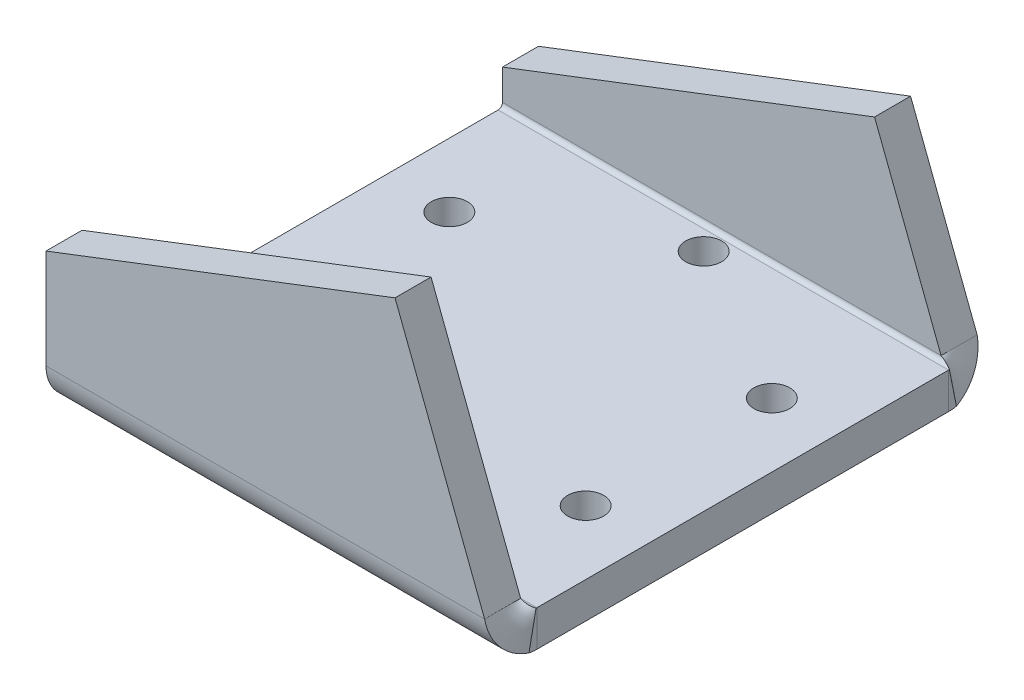
ISO-10303-21;
HEADER;
FILE_DESCRIPTION(('STEP AP214'),'2;1');
FILE_NAME('part.step','',(''),(''),'','','');
FILE_SCHEMA(('AUTOMOTIVE_DESIGN { 1 0 10303 214 1 1 1 1 }'));
ENDSEC;
DATA;
#1=APPLICATION_CONTEXT('core data for automotive mechanical design processes');
#2=APPLICATION_PROTOCOL_DEFINITION('international standard','automotive_design',2000,#1);
#3=PRODUCT_CONTEXT('',#1,'mechanical');
#4=PRODUCT('Part','Part','',(#3));
#5=PRODUCT_RELATED_PRODUCT_CATEGORY('part','',(#4));
#6=PRODUCT_DEFINITION_FORMATION('','',#4);
#7=PRODUCT_DEFINITION_CONTEXT('part definition',#1,'design');
#8=PRODUCT_DEFINITION('design','',#6,#7);
#9=PRODUCT_DEFINITION_SHAPE('','',#8);
#10=(LENGTH_UNIT() NAMED_UNIT(*) SI_UNIT(.MILLI.,.METRE.));
#11=(NAMED_UNIT(*) PLANE_ANGLE_UNIT() SI_UNIT($,.RADIAN.));
#12=(NAMED_UNIT(*) SI_UNIT($,.STERADIAN.) SOLID_ANGLE_UNIT());
#13=UNCERTAINTY_MEASURE_WITH_UNIT(LENGTH_MEASURE(1.E-05),#10,'distance_accuracy_value','');
#14=(GEOMETRIC_REPRESENTATION_CONTEXT(3) GLOBAL_UNCERTAINTY_ASSIGNED_CONTEXT((#13)) GLOBAL_UNIT_ASSIGNED_CONTEXT((#10,
#11,#12)) REPRESENTATION_CONTEXT('',''));
#15=CARTESIAN_POINT('',(0.,0.,0.));
#16=DIRECTION('',(0.,0.,1.));
#17=DIRECTION('',(1.,0.,0.));
#18=AXIS2_PLACEMENT_3D('',#15,#16,#17);
#19=CARTESIAN_POINT('',(0.,-6.,0.));
#20=DIRECTION('',(0.,-1.,0.));
#21=DIRECTION('',(0.,0.,-1.));
#22=AXIS2_PLACEMENT_3D('',#19,#20,#21);
#23=PLANE('',#22);
#24=CARTESIAN_POINT('',(-37.5,-6.,-4.));
#25=DIRECTION('',(0.,-1.,0.));
#26=DIRECTION('',(0.,0.,-1.));
#27=AXIS2_PLACEMENT_3D('',#24,#25,#26);
#28=CIRCLE('',#27,3.);
#29=CARTESIAN_POINT('',(-37.5,-6.,-7.));
#30=VERTEX_POINT('',#29);
#31=EDGE_CURVE('E450',#30,#30,#28,.T.);
#32=ORIENTED_EDGE('',*,*,#31,.F.);
#33=EDGE_LOOP('',(#32));
#34=FACE_BOUND('',#33,.T.);
#35=CARTESIAN_POINT('',(-64.346787517317,-6.,-19.5000000000004));
#36=DIRECTION('',(0.,-1.,0.));
#37=DIRECTION('',(0.,0.,-1.));
#38=AXIS2_PLACEMENT_3D('',#35,#36,#37);
#39=CIRCLE('',#38,3.00000000000001);
#40=CARTESIAN_POINT('',(-64.346787517317,-6.,-22.5000000000005));
#41=VERTEX_POINT('',#40);
#42=EDGE_CURVE('E460',#41,#41,#39,.T.);
#43=ORIENTED_EDGE('',*,*,#42,.F.);
#44=EDGE_LOOP('',(#43));
#45=FACE_BOUND('',#44,.T.);
#46=CARTESIAN_POINT('',(-64.3467875173165,-6.,-50.5000000000005));
#47=DIRECTION('',(0.,-1.,0.));
#48=DIRECTION('',(0.,0.,-1.));
#49=AXIS2_PLACEMENT_3D('',#46,#47,#48);
#50=CIRCLE('',#49,2.99999999999999);
#51=CARTESIAN_POINT('',(-64.3467875173165,-6.,-53.5000000000005));
#52=VERTEX_POINT('',#51);
#53=EDGE_CURVE('E463',#52,#52,#50,.T.);
#54=ORIENTED_EDGE('',*,*,#53,.F.);
#55=EDGE_LOOP('',(#54));
#56=FACE_BOUND('',#55,.T.);
#57=CARTESIAN_POINT('',(-37.4999999999985,-6.,-66.));
#58=DIRECTION('',(0.,-1.,0.));
#59=DIRECTION('',(0.,0.,-1.));
#60=AXIS2_PLACEMENT_3D('',#57,#58,#59);
#61=CIRCLE('',#60,3.);
#62=CARTESIAN_POINT('',(-37.4999999999985,-6.,-69.));
#63=VERTEX_POINT('',#62);
#64=EDGE_CURVE('E469',#63,#63,#61,.T.);
#65=ORIENTED_EDGE('',*,*,#64,.F.);
#66=EDGE_LOOP('',(#65));
#67=FACE_BOUND('',#66,.T.);
#68=CARTESIAN_POINT('',(-10.6532124826812,-6.,-50.4999999999994));
#69=DIRECTION('',(0.,-1.,0.));
#70=DIRECTION('',(0.,0.,-1.));
#71=AXIS2_PLACEMENT_3D('',#68,#69,#70);
#72=CIRCLE('',#71,3.);
#73=CARTESIAN_POINT('',(-10.6532124826812,-6.,-53.4999999999994));
#74=VERTEX_POINT('',#73);
#75=EDGE_CURVE('E466',#74,#74,#72,.T.);
#76=ORIENTED_EDGE('',*,*,#75,.F.);
#77=EDGE_LOOP('',(#76));
#78=FACE_BOUND('',#77,.T.);
#79=CARTESIAN_POINT('',(-10.6532124826819,-6.,-19.4999999999993));
#80=DIRECTION('',(0.,-1.,0.));
#81=DIRECTION('',(0.,0.,-1.));
#82=AXIS2_PLACEMENT_3D('',#79,#80,#81);
#83=CIRCLE('',#82,3.);
#84=CARTESIAN_POINT('',(-10.6532124826819,-6.,-22.4999999999993));
#85=VERTEX_POINT('',#84);
#86=EDGE_CURVE('E459',#85,#85,#83,.T.);
#87=ORIENTED_EDGE('',*,*,#86,.F.);
#88=EDGE_LOOP('',(#87));
#89=FACE_BOUND('',#88,.T.);
#90=DIRECTION('',(0.,0.,-1.));
#91=VECTOR('',#90,1.);
#92=CARTESIAN_POINT('',(0.,-6.,0.));
#93=LINE('',#92,#91);
#94=CARTESIAN_POINT('',(0.,-6.,-0.736599999999992));
#95=VERTEX_POINT('',#94);
#96=CARTESIAN_POINT('',(0.,-6.,-69.2634));
#97=VERTEX_POINT('',#96);
#98=EDGE_CURVE('E534',#95,#97,#93,.T.);
#99=ORIENTED_EDGE('',*,*,#98,.F.);
#100=DIRECTION('',(-1.,0.,0.));
#101=VECTOR('',#100,1.);
#102=CARTESIAN_POINT('',(0.,-6.,-0.736600000000001));
#103=LINE('',#102,#101);
#104=CARTESIAN_POINT('',(-74.9999999999999,-6.,-0.736600000000004));
#105=VERTEX_POINT('',#104);
#106=EDGE_CURVE('E503',#95,#105,#103,.T.);
#107=ORIENTED_EDGE('',*,*,#106,.T.);
#108=DIRECTION('',(0.,0.,1.));
#109=VECTOR('',#108,1.);
#110=CARTESIAN_POINT('',(-75.,-6.,-80.2201516837288));
#111=LINE('',#110,#109);
#112=CARTESIAN_POINT('',(-75.,-6.,-69.2634));
#113=VERTEX_POINT('',#112);
#114=EDGE_CURVE('E495',#113,#105,#111,.T.);
#115=ORIENTED_EDGE('',*,*,#114,.F.);
#116=DIRECTION('',(-1.,0.,0.));
#117=VECTOR('',#116,1.);
#118=CARTESIAN_POINT('',(0.,-6.,-69.2634));
#119=LINE('',#118,#117);
#120=EDGE_CURVE('E491',#97,#113,#119,.T.);
#121=ORIENTED_EDGE('',*,*,#120,.F.);
#122=EDGE_LOOP('',(#99,#107,#115,#121));
#123=FACE_BOUND('',#122,.T.);
#124=ADVANCED_FACE('F61',(#34,#45,#56,#67,#78,#89,#123),#23,.T.);
#125=CARTESIAN_POINT('',(0.,-6.,0.));
#126=DIRECTION('',(1.,0.,0.));
#127=DIRECTION('',(0.,0.,-1.));
#128=AXIS2_PLACEMENT_3D('',#125,#126,#127);
#129=PLANE('',#128);
#130=DIRECTION('',(0.,0.,-1.));
#131=VECTOR('',#130,1.);
#132=CARTESIAN_POINT('',(0.,0.,0.));
#133=LINE('',#132,#131);
#134=CARTESIAN_POINT('',(0.,0.,-0.736600000000001));
#135=VERTEX_POINT('',#134);
#136=CARTESIAN_POINT('',(0.,0.,-69.2634));
#137=VERTEX_POINT('',#136);
#138=EDGE_CURVE('E86',#135,#137,#133,.T.);
#139=ORIENTED_EDGE('',*,*,#138,.F.);
#140=DIRECTION('',(0.,-1.,0.));
#141=VECTOR('',#140,1.);
#142=CARTESIAN_POINT('',(0.,-6.,-0.736600000000001));
#143=LINE('',#142,#141);
#144=EDGE_CURVE('E530',#135,#95,#143,.T.);
#145=ORIENTED_EDGE('',*,*,#144,.T.);
#146=ORIENTED_EDGE('',*,*,#98,.T.);
#147=DIRECTION('',(0.,-1.,0.));
#148=VECTOR('',#147,1.);
#149=CARTESIAN_POINT('',(0.,-6.,-69.2634));
#150=LINE('',#149,#148);
#151=EDGE_CURVE('E500',#137,#97,#150,.T.);
#152=ORIENTED_EDGE('',*,*,#151,.F.);
#153=EDGE_LOOP('',(#139,#145,#146,#152));
#154=FACE_BOUND('',#153,.T.);
#155=ADVANCED_FACE('F578',(#154),#129,.T.);
#156=CARTESIAN_POINT('',(-75.,-6.,21.6936676576655));
#157=DIRECTION('',(-1.,0.,0.));
#158=DIRECTION('',(0.,0.,1.));
#159=AXIS2_PLACEMENT_3D('',#156,#157,#158);
#160=PLANE('',#159);
#161=ORIENTED_EDGE('',*,*,#114,.T.);
#162=DIRECTION('',(0.,1.,0.));
#163=VECTOR('',#162,1.);
#164=CARTESIAN_POINT('',(-75.,-6.,-0.736599999999997));
#165=LINE('',#164,#163);
#166=CARTESIAN_POINT('',(-75.,0.,-0.736599999999997));
#167=VERTEX_POINT('',#166);
#168=EDGE_CURVE('E12',#105,#167,#165,.T.);
#169=ORIENTED_EDGE('',*,*,#168,.T.);
#170=DIRECTION('',(0.,0.,1.));
#171=VECTOR('',#170,1.);
#172=CARTESIAN_POINT('',(-75.,0.,21.6936676576655));
#173=LINE('',#172,#171);
#174=CARTESIAN_POINT('',(-75.,0.,-69.2634));
#175=VERTEX_POINT('',#174);
#176=EDGE_CURVE('E537',#175,#167,#173,.T.);
#177=ORIENTED_EDGE('',*,*,#176,.F.);
#178=DIRECTION('',(0.,1.,0.));
#179=VECTOR('',#178,1.);
#180=CARTESIAN_POINT('',(-75.,-6.00000000000001,-69.2634));
#181=LINE('',#180,#179);
#182=EDGE_CURVE('E494',#113,#175,#181,.T.);
#183=ORIENTED_EDGE('',*,*,#182,.F.);
#184=EDGE_LOOP('',(#161,#169,#177,#183));
#185=FACE_BOUND('',#184,.T.);
#186=ADVANCED_FACE('F63',(#185),#160,.T.);
#187=CARTESIAN_POINT('',(0.,0.,0.));
#188=DIRECTION('',(0.,-1.,0.));
#189=DIRECTION('',(0.,0.,-1.));
#190=AXIS2_PLACEMENT_3D('',#187,#188,#189);
#191=PLANE('',#190);
#192=DIRECTION('',(-1.,0.,0.));
#193=VECTOR('',#192,1.);
#194=CARTESIAN_POINT('',(0.,0.,-0.736600000000001));
#195=LINE('',#194,#193);
#196=EDGE_CURVE('E70',#135,#167,#195,.T.);
#197=ORIENTED_EDGE('',*,*,#196,.F.);
#198=ORIENTED_EDGE('',*,*,#138,.T.);
#199=DIRECTION('',(-1.,0.,0.));
#200=VECTOR('',#199,1.);
#201=CARTESIAN_POINT('',(0.,0.,-69.2634));
#202=LINE('',#201,#200);
#203=EDGE_CURVE('E498',#137,#175,#202,.T.);
#204=ORIENTED_EDGE('',*,*,#203,.T.);
#205=ORIENTED_EDGE('',*,*,#176,.T.);
#206=EDGE_LOOP('',(#197,#198,#204,#205));
#207=FACE_BOUND('',#206,.T.);
#208=CARTESIAN_POINT('',(-37.5,0.,-4.));
#209=DIRECTION('',(0.,-1.,0.));
#210=DIRECTION('',(0.,0.,-1.));
#211=AXIS2_PLACEMENT_3D('',#208,#209,#210);
#212=CIRCLE('',#211,3.);
#213=CARTESIAN_POINT('',(-37.5,0.,-7.));
#214=VERTEX_POINT('',#213);
#215=EDGE_CURVE('E488',#214,#214,#212,.T.);
#216=ORIENTED_EDGE('',*,*,#215,.T.);
#217=EDGE_LOOP('',(#216));
#218=FACE_BOUND('',#217,.T.);
#219=CARTESIAN_POINT('',(-64.346787517317,0.,-19.5000000000004));
#220=DIRECTION('',(0.,-1.,0.));
#221=DIRECTION('',(0.,0.,-1.));
#222=AXIS2_PLACEMENT_3D('',#219,#220,#221);
#223=CIRCLE('',#222,3.00000000000001);
#224=CARTESIAN_POINT('',(-64.346787517317,0.,-22.5000000000005));
#225=VERTEX_POINT('',#224);
#226=EDGE_CURVE('E485',#225,#225,#223,.T.);
#227=ORIENTED_EDGE('',*,*,#226,.T.);
#228=EDGE_LOOP('',(#227));
#229=FACE_BOUND('',#228,.T.);
#230=CARTESIAN_POINT('',(-64.3467875173165,0.,-50.5000000000005));
#231=DIRECTION('',(0.,-1.,0.));
#232=DIRECTION('',(0.,0.,-1.));
#233=AXIS2_PLACEMENT_3D('',#230,#231,#232);
#234=CIRCLE('',#233,2.99999999999999);
#235=CARTESIAN_POINT('',(-64.3467875173165,0.,-53.5000000000005));
#236=VERTEX_POINT('',#235);
#237=EDGE_CURVE('E482',#236,#236,#234,.T.);
#238=ORIENTED_EDGE('',*,*,#237,.T.);
#239=EDGE_LOOP('',(#238));
#240=FACE_BOUND('',#239,.T.);
#241=CARTESIAN_POINT('',(-37.4999999999985,0.,-66.));
#242=DIRECTION('',(0.,-1.,0.));
#243=DIRECTION('',(0.,0.,-1.));
#244=AXIS2_PLACEMENT_3D('',#241,#242,#243);
#245=CIRCLE('',#244,3.);
#246=CARTESIAN_POINT('',(-37.4999999999985,0.,-69.));
#247=VERTEX_POINT('',#246);
#248=EDGE_CURVE('E479',#247,#247,#245,.T.);
#249=ORIENTED_EDGE('',*,*,#248,.T.);
#250=EDGE_LOOP('',(#249));
#251=FACE_BOUND('',#250,.T.);
#252=CARTESIAN_POINT('',(-10.6532124826812,0.,-50.4999999999994));
#253=DIRECTION('',(0.,-1.,0.));
#254=DIRECTION('',(0.,0.,-1.));
#255=AXIS2_PLACEMENT_3D('',#252,#253,#254);
#256=CIRCLE('',#255,3.);
#257=CARTESIAN_POINT('',(-10.6532124826812,0.,-53.4999999999994));
#258=VERTEX_POINT('',#257);
#259=EDGE_CURVE('E476',#258,#258,#256,.T.);
#260=ORIENTED_EDGE('',*,*,#259,.T.);
#261=EDGE_LOOP('',(#260));
#262=FACE_BOUND('',#261,.T.);
#263=CARTESIAN_POINT('',(-10.6532124826819,0.,-19.4999999999993));
#264=DIRECTION('',(0.,-1.,0.));
#265=DIRECTION('',(0.,0.,-1.));
#266=AXIS2_PLACEMENT_3D('',#263,#264,#265);
#267=CIRCLE('',#266,3.);
#268=CARTESIAN_POINT('',(-10.6532124826819,0.,-22.4999999999993));
#269=VERTEX_POINT('',#268);
#270=EDGE_CURVE('E458',#269,#269,#267,.T.);
#271=ORIENTED_EDGE('',*,*,#270,.T.);
#272=EDGE_LOOP('',(#271));
#273=FACE_BOUND('',#272,.T.);
#274=ADVANCED_FACE('F589',(#207,#218,#229,#240,#251,#262,#273),#191,.F.);
#275=CARTESIAN_POINT('',(-10.6532124826819,4.,-19.4999999999993));
#276=DIRECTION('',(0.,-1.,0.));
#277=DIRECTION('',(0.,0.,-1.));
#278=AXIS2_PLACEMENT_3D('',#275,#276,#277);
#279=CYLINDRICAL_SURFACE('',#278,3.);
#280=ORIENTED_EDGE('',*,*,#86,.T.);
#281=EDGE_LOOP('',(#280));
#282=FACE_BOUND('',#281,.T.);
#283=ORIENTED_EDGE('',*,*,#270,.F.);
#284=EDGE_LOOP('',(#283));
#285=FACE_BOUND('',#284,.T.);
#286=ADVANCED_FACE('F591',(#282,#285),#279,.F.);
#287=CARTESIAN_POINT('',(-10.6532124826812,4.,-50.4999999999994));
#288=DIRECTION('',(0.,-1.,0.));
#289=DIRECTION('',(0.,0.,-1.));
#290=AXIS2_PLACEMENT_3D('',#287,#288,#289);
#291=CYLINDRICAL_SURFACE('',#290,3.);
#292=ORIENTED_EDGE('',*,*,#75,.T.);
#293=EDGE_LOOP('',(#292));
#294=FACE_BOUND('',#293,.T.);
#295=ORIENTED_EDGE('',*,*,#259,.F.);
#296=EDGE_LOOP('',(#295));
#297=FACE_BOUND('',#296,.T.);
#298=ADVANCED_FACE('F596',(#294,#297),#291,.F.);
#299=CARTESIAN_POINT('',(-37.4999999999985,4.,-66.));
#300=DIRECTION('',(0.,-1.,0.));
#301=DIRECTION('',(0.,0.,-1.));
#302=AXIS2_PLACEMENT_3D('',#299,#300,#301);
#303=CYLINDRICAL_SURFACE('',#302,3.);
#304=ORIENTED_EDGE('',*,*,#64,.T.);
#305=EDGE_LOOP('',(#304));
#306=FACE_BOUND('',#305,.T.);
#307=ORIENTED_EDGE('',*,*,#248,.F.);
#308=EDGE_LOOP('',(#307));
#309=FACE_BOUND('',#308,.T.);
#310=ADVANCED_FACE('F615',(#306,#309),#303,.F.);
#311=CARTESIAN_POINT('',(-64.3467875173165,4.,-50.5000000000005));
#312=DIRECTION('',(0.,-1.,0.));
#313=DIRECTION('',(0.,0.,-1.));
#314=AXIS2_PLACEMENT_3D('',#311,#312,#313);
#315=CYLINDRICAL_SURFACE('',#314,2.99999999999999);
#316=ORIENTED_EDGE('',*,*,#53,.T.);
#317=EDGE_LOOP('',(#316));
#318=FACE_BOUND('',#317,.T.);
#319=ORIENTED_EDGE('',*,*,#237,.F.);
#320=EDGE_LOOP('',(#319));
#321=FACE_BOUND('',#320,.T.);
#322=ADVANCED_FACE('F621',(#318,#321),#315,.F.);
#323=CARTESIAN_POINT('',(-64.346787517317,4.,-19.5000000000004));
#324=DIRECTION('',(0.,-1.,0.));
#325=DIRECTION('',(0.,0.,-1.));
#326=AXIS2_PLACEMENT_3D('',#323,#324,#325);
#327=CYLINDRICAL_SURFACE('',#326,3.00000000000001);
#328=ORIENTED_EDGE('',*,*,#42,.T.);
#329=EDGE_LOOP('',(#328));
#330=FACE_BOUND('',#329,.T.);
#331=ORIENTED_EDGE('',*,*,#226,.F.);
#332=EDGE_LOOP('',(#331));
#333=FACE_BOUND('',#332,.T.);
#334=ADVANCED_FACE('F626',(#330,#333),#327,.F.);
#335=CARTESIAN_POINT('',(-37.5,4.,-4.));
#336=DIRECTION('',(0.,-1.,0.));
#337=DIRECTION('',(0.,0.,-1.));
#338=AXIS2_PLACEMENT_3D('',#335,#336,#337);
#339=CYLINDRICAL_SURFACE('',#338,3.);
#340=ORIENTED_EDGE('',*,*,#31,.T.);
#341=EDGE_LOOP('',(#340));
#342=FACE_BOUND('',#341,.T.);
#343=ORIENTED_EDGE('',*,*,#215,.F.);
#344=EDGE_LOOP('',(#343));
#345=FACE_BOUND('',#344,.T.);
#346=ADVANCED_FACE('F412',(#342,#345),#339,.F.);
#347=CARTESIAN_POINT('',(-1.97031173492913,0.736599999999999,-76.));
#348=CARTESIAN_POINT('',(-1.80610249301158,-0.0346307257912084,-76.));
#349=CARTESIAN_POINT('',(-1.64192644577427,-0.805527788732326,-75.8663007295514));
#350=CARTESIAN_POINT('',(-1.31354115661941,-2.25777791636665,-75.3469973777911));
#351=CARTESIAN_POINT('',(-1.14934851204199,-2.93871826907082,-74.961513001874));
#352=CARTESIAN_POINT('',(-0.820963222887131,-4.13131883001277,-73.9835506782621));
#353=CARTESIAN_POINT('',(-0.656770578309721,-4.64270413010629,-73.3912981621295));
#354=CARTESIAN_POINT('',(-0.328385289154867,-5.4363829219871,-72.068883560092));
#355=CARTESIAN_POINT('',(-0.164209241917553,-5.71847819432906,-71.3391027478668));
#356=CARTESIAN_POINT('',(0.,-5.8695289656632,-70.5828088255828));
#357=CARTESIAN_POINT('',(-1.97031173492913,0.7366,-70.));
#358=CARTESIAN_POINT('',(-1.80611546962609,0.652277988971885,-70.));
#359=CARTESIAN_POINT('',(-1.64192644577427,0.56797913351242,-69.9853809217391));
#360=CARTESIAN_POINT('',(-1.31354115661941,0.409185759404496,-69.9285987394948));
#361=CARTESIAN_POINT('',(-1.14934851204199,0.334729703856906,-69.8864487244575));
#362=CARTESIAN_POINT('',(-0.820963222887131,0.204327190246207,-69.7795153979171));
#363=CARTESIAN_POINT('',(-0.656770578309721,0.148410791462119,-69.7147567357754));
#364=CARTESIAN_POINT('',(-0.328385289154867,0.0616275776599933,-69.5701599665059));
#365=CARTESIAN_POINT('',(-0.164196265303052,0.0307811313472491,-69.4903570139863));
#366=CARTESIAN_POINT('',(0.,0.0142660932655183,-69.4076681086786));
#367=B_SPLINE_SURFACE_WITH_KNOTS('',1,3,((#347,#348,#349,#350,#351,#352,#353,#354,#355,#356),
(#357,#358,#359,#360,#361,#362,#363,#364,#365,#366)),.UNSPECIFIED.,.F.,.F.,.F.,(2,2),(4,2,2,2,
4),(0.,1.),(0.,0.25,0.5,0.75,1.),.UNSPECIFIED.);
#368=CARTESIAN_POINT('',(-1.97031173492913,0.736599999999999,-76.));
#369=CARTESIAN_POINT('',(-1.97031173492913,0.7366,-70.));
#370=B_SPLINE_CURVE_WITH_KNOTS('',1,(#368,#369),.UNSPECIFIED.,.F.,.F.,(2,2),(0.,1.),.UNSPECIFIED.);
#371=CARTESIAN_POINT('',(-1.97031173492914,0.73659999999999,-70.));
#372=VERTEX_POINT('',#371);
#373=CARTESIAN_POINT('',(-1.97031173492913,0.736600000000014,-76.));
#374=VERTEX_POINT('',#373);
#375=EDGE_CURVE('E318',#372,#374,#370,.F.);
#376=CARTESIAN_POINT('',(-1.97031173492913,0.7366,-70.));
#377=CARTESIAN_POINT('',(-1.80611546962609,0.652277988971885,-70.));
#378=CARTESIAN_POINT('',(-1.64192644577427,0.56797913351242,-69.9853809217391));
#379=CARTESIAN_POINT('',(-1.31354115661941,0.409185759404496,-69.9285987394948));
#380=CARTESIAN_POINT('',(-1.14934851204199,0.334729703856906,-69.8864487244575));
#381=CARTESIAN_POINT('',(-0.820963222887131,0.204327190246207,-69.7795153979171));
#382=CARTESIAN_POINT('',(-0.656770578309721,0.148410791462119,-69.7147567357754));
#383=CARTESIAN_POINT('',(-0.328385289154867,0.0616275776599933,-69.5701599665059));
#384=CARTESIAN_POINT('',(-0.164196265303052,0.0307811313472491,-69.4903570139863));
#385=CARTESIAN_POINT('',(0.,0.0142660932655183,-69.4076681086786));
#386=B_SPLINE_CURVE_WITH_KNOTS('',3,(#376,#377,#378,#379,#380,#381,#382,#383,#384,#385),
.UNSPECIFIED.,.F.,.F.,(4,2,2,2,4),(0.,0.25,0.5,0.75,1.),.UNSPECIFIED.);
#387=CARTESIAN_POINT('',(0.,0.0142660932655182,-69.4076681086786));
#388=VERTEX_POINT('',#387);
#389=EDGE_CURVE('E314',#372,#388,#386,.T.);
#390=CARTESIAN_POINT('',(0.,0.0142660932655183,-69.4076681086786));
#391=CARTESIAN_POINT('',(0.,-5.8695289656632,-70.5828088255828));
#392=B_SPLINE_CURVE_WITH_KNOTS('',1,(#390,#391),.UNSPECIFIED.,.F.,.F.,(2,2),(0.,1.),.UNSPECIFIED.);
#393=CARTESIAN_POINT('',(0.,-5.8695289656632,-70.5828088255828));
#394=VERTEX_POINT('',#393);
#395=EDGE_CURVE('E340',#388,#394,#392,.T.);
#396=CARTESIAN_POINT('',(0.,-5.8695289656632,-70.5828088255828));
#397=CARTESIAN_POINT('',(-0.164209241917553,-5.71847819432906,-71.3391027478668));
#398=CARTESIAN_POINT('',(-0.328385289154867,-5.4363829219871,-72.068883560092));
#399=CARTESIAN_POINT('',(-0.656770578309721,-4.64270413010629,-73.3912981621295));
#400=CARTESIAN_POINT('',(-0.820963222887131,-4.13131883001277,-73.9835506782621));
#401=CARTESIAN_POINT('',(-1.14934851204199,-2.93871826907082,-74.961513001874));
#402=CARTESIAN_POINT('',(-1.31354115661941,-2.25777791636665,-75.3469973777911));
#403=CARTESIAN_POINT('',(-1.64192644577427,-0.805527788732326,-75.8663007295514));
#404=CARTESIAN_POINT('',(-1.80610249301158,-0.0346307257912084,-76.));
#405=CARTESIAN_POINT('',(-1.97031173492913,0.736599999999999,-76.));
#406=B_SPLINE_CURVE_WITH_KNOTS('',3,(#396,#397,#398,#399,#400,#401,#402,#403,#404,#405),
.UNSPECIFIED.,.F.,.F.,(4,2,2,2,4),(0.,0.25,0.5,0.75,1.),.UNSPECIFIED.);
#407=EDGE_CURVE('E345',#374,#394,#406,.F.);
#408=ORIENTED_EDGE('',*,*,#375,.F.);
#409=ORIENTED_EDGE('',*,*,#389,.T.);
#410=ORIENTED_EDGE('',*,*,#395,.T.);
#411=ORIENTED_EDGE('',*,*,#407,.F.);
#412=EDGE_LOOP('',(#408,#409,#410,#411));
#413=FACE_BOUND('',#412,.T.);
#414=ADVANCED_FACE('F401',(#413),#367,.T.);
#415=CARTESIAN_POINT('',(0.,0.7366,-69.2634));
#416=DIRECTION('',(1.,0.,0.));
#417=DIRECTION('',(0.,0.,-1.));
#418=AXIS2_PLACEMENT_3D('',#415,#416,#417);
#419=PLANE('',#418);
#420=ORIENTED_EDGE('',*,*,#395,.F.);
#421=CARTESIAN_POINT('',(0.,0.7366,-69.2634));
#422=DIRECTION('',(1.,0.,0.));
#423=DIRECTION('',(0.,0.,-1.));
#424=AXIS2_PLACEMENT_3D('',#421,#422,#423);
#425=CIRCLE('',#424,0.7366);
#426=EDGE_CURVE('E346',#388,#137,#425,.F.);
#427=ORIENTED_EDGE('',*,*,#426,.T.);
#428=ORIENTED_EDGE('',*,*,#151,.T.);
#429=CARTESIAN_POINT('',(0.,0.7366,-69.2634));
#430=DIRECTION('',(-1.,0.,0.));
#431=DIRECTION('',(0.,0.,-1.));
#432=AXIS2_PLACEMENT_3D('',#429,#430,#431);
#433=CIRCLE('',#432,6.7366);
#434=EDGE_CURVE('E341',#394,#97,#433,.T.);
#435=ORIENTED_EDGE('',*,*,#434,.F.);
#436=EDGE_LOOP('',(#420,#427,#428,#435));
#437=FACE_BOUND('',#436,.T.);
#438=ADVANCED_FACE('F377',(#437),#419,.T.);
#439=CARTESIAN_POINT('',(-75.,0.7366,-69.2634));
#440=DIRECTION('',(-1.,0.,0.));
#441=DIRECTION('',(0.,0.,1.));
#442=AXIS2_PLACEMENT_3D('',#439,#440,#441);
#443=PLANE('',#442);
#444=CARTESIAN_POINT('',(-75.,0.7366,-69.2634));
#445=DIRECTION('',(1.,0.,0.));
#446=DIRECTION('',(0.,0.,-1.));
#447=AXIS2_PLACEMENT_3D('',#444,#445,#446);
#448=CIRCLE('',#447,0.7366);
#449=CARTESIAN_POINT('',(-75.,0.73659999999999,-70.));
#450=VERTEX_POINT('',#449);
#451=EDGE_CURVE('E342',#175,#450,#448,.T.);
#452=ORIENTED_EDGE('',*,*,#451,.T.);
#453=DIRECTION('',(0.,0.,1.));
#454=VECTOR('',#453,1.);
#455=CARTESIAN_POINT('',(-75.,0.736600000000018,-76.));
#456=LINE('',#455,#454);
#457=CARTESIAN_POINT('',(-75.,0.736600000000018,-76.));
#458=VERTEX_POINT('',#457);
#459=EDGE_CURVE('E323',#458,#450,#456,.T.);
#460=ORIENTED_EDGE('',*,*,#459,.F.);
#461=CARTESIAN_POINT('',(-75.,0.7366,-69.2634));
#462=DIRECTION('',(1.,0.,0.));
#463=DIRECTION('',(0.,0.,1.));
#464=AXIS2_PLACEMENT_3D('',#461,#462,#463);
#465=CIRCLE('',#464,6.7366);
#466=EDGE_CURVE('E337',#113,#458,#465,.T.);
#467=ORIENTED_EDGE('',*,*,#466,.F.);
#468=ORIENTED_EDGE('',*,*,#182,.T.);
#469=EDGE_LOOP('',(#452,#460,#467,#468));
#470=FACE_BOUND('',#469,.T.);
#471=ADVANCED_FACE('F368',(#470),#443,.T.);
#472=CARTESIAN_POINT('',(-112.968207194875,0.7366,-69.2634));
#473=DIRECTION('',(1.,0.,0.));
#474=DIRECTION('',(0.,0.,-1.));
#475=AXIS2_PLACEMENT_3D('',#472,#473,#474);
#476=CYLINDRICAL_SURFACE('',#475,6.7366);
#477=ORIENTED_EDGE('',*,*,#120,.T.);
#478=ORIENTED_EDGE('',*,*,#466,.T.);
#479=DIRECTION('',(-1.,0.,0.));
#480=VECTOR('',#479,1.);
#481=CARTESIAN_POINT('',(0.,0.736600000000018,-76.));
#482=LINE('',#481,#480);
#483=EDGE_CURVE('E329',#374,#458,#482,.T.);
#484=ORIENTED_EDGE('',*,*,#483,.F.);
#485=ORIENTED_EDGE('',*,*,#407,.T.);
#486=ORIENTED_EDGE('',*,*,#434,.T.);
#487=EDGE_LOOP('',(#477,#478,#484,#485,#486));
#488=FACE_BOUND('',#487,.T.);
#489=ADVANCED_FACE('F357',(#488),#476,.T.);
#490=CARTESIAN_POINT('',(-112.968207194875,0.7366,-69.2634));
#491=DIRECTION('',(1.,0.,0.));
#492=DIRECTION('',(0.,0.,-1.));
#493=AXIS2_PLACEMENT_3D('',#490,#491,#492);
#494=CYLINDRICAL_SURFACE('',#493,0.7366);
#495=ORIENTED_EDGE('',*,*,#203,.F.);
#496=ORIENTED_EDGE('',*,*,#426,.F.);
#497=ORIENTED_EDGE('',*,*,#389,.F.);
#498=DIRECTION('',(-1.,0.,0.));
#499=VECTOR('',#498,1.);
#500=CARTESIAN_POINT('',(0.,0.73659999999999,-70.));
#501=LINE('',#500,#499);
#502=EDGE_CURVE('E336',#372,#450,#501,.T.);
#503=ORIENTED_EDGE('',*,*,#502,.T.);
#504=ORIENTED_EDGE('',*,*,#451,.F.);
#505=EDGE_LOOP('',(#495,#496,#497,#503,#504));
#506=FACE_BOUND('',#505,.T.);
#507=ADVANCED_FACE('F367',(#506),#494,.F.);
#508=CARTESIAN_POINT('',(-13.051377191204,29.6037624452982,-75.9999999999999));
#509=DIRECTION('',(-0.358367949545298,0.933580426497203,0.));
#510=DIRECTION('',(-0.933580426497203,-0.358367949545298,0.));
#511=AXIS2_PLACEMENT_3D('',#508,#509,#510);
#512=PLANE('',#511);
#513=DIRECTION('',(-0.933580426497203,-0.358367949545298,0.));
#514=VECTOR('',#513,1.);
#515=CARTESIAN_POINT('',(-13.051377191204,29.6037624452982,-69.9999999999999));
#516=LINE('',#515,#514);
#517=CARTESIAN_POINT('',(-13.051377191204,29.6037624452982,-69.9999999999999));
#518=VERTEX_POINT('',#517);
#519=CARTESIAN_POINT('',(-75.,5.82391412902693,-70.));
#520=VERTEX_POINT('',#519);
#521=EDGE_CURVE('E319',#518,#520,#516,.T.);
#522=ORIENTED_EDGE('',*,*,#521,.F.);
#523=DIRECTION('',(0.,0.,1.));
#524=VECTOR('',#523,1.);
#525=CARTESIAN_POINT('',(-13.051377191204,29.6037624452982,-75.9999999999999));
#526=LINE('',#525,#524);
#527=CARTESIAN_POINT('',(-13.051377191204,29.6037624452982,-75.9999999999999));
#528=VERTEX_POINT('',#527);
#529=EDGE_CURVE('E306',#528,#518,#526,.T.);
#530=ORIENTED_EDGE('',*,*,#529,.F.);
#531=DIRECTION('',(-0.933580426497203,-0.358367949545298,0.));
#532=VECTOR('',#531,1.);
#533=CARTESIAN_POINT('',(-13.051377191204,29.6037624452982,-75.9999999999999));
#534=LINE('',#533,#532);
#535=CARTESIAN_POINT('',(-75.,5.82391412902696,-76.));
#536=VERTEX_POINT('',#535);
#537=EDGE_CURVE('E333',#528,#536,#534,.T.);
#538=ORIENTED_EDGE('',*,*,#537,.T.);
#539=DIRECTION('',(0.,0.,1.));
#540=VECTOR('',#539,1.);
#541=CARTESIAN_POINT('',(-75.,5.82391412902696,-76.));
#542=LINE('',#541,#540);
#543=EDGE_CURVE('E330',#536,#520,#542,.T.);
#544=ORIENTED_EDGE('',*,*,#543,.T.);
#545=EDGE_LOOP('',(#522,#530,#538,#544));
#546=FACE_BOUND('',#545,.T.);
#547=ADVANCED_FACE('F375',(#546),#512,.T.);
#548=CARTESIAN_POINT('',(0.,-74.3962375547018,-76.0000000000003));
#549=DIRECTION('',(0.,0.,-1.));
#550=DIRECTION('',(0.,1.,0.));
#551=AXIS2_PLACEMENT_3D('',#548,#549,#550);
#552=PLANE('',#551);
#553=DIRECTION('',(-0.358367949545298,0.933580426497203,0.));
#554=VECTOR('',#553,1.);
#555=CARTESIAN_POINT('',(-13.051377191204,29.6037624452982,-75.9999999999999));
#556=LINE('',#555,#554);
#557=EDGE_CURVE('E315',#374,#528,#556,.T.);
#558=ORIENTED_EDGE('',*,*,#557,.F.);
#559=ORIENTED_EDGE('',*,*,#483,.T.);
#560=DIRECTION('',(0.,-1.,0.));
#561=VECTOR('',#560,1.);
#562=CARTESIAN_POINT('',(-75.,5.82391412902696,-76.));
#563=LINE('',#562,#561);
#564=EDGE_CURVE('E326',#536,#458,#563,.T.);
#565=ORIENTED_EDGE('',*,*,#564,.F.);
#566=ORIENTED_EDGE('',*,*,#537,.F.);
#567=EDGE_LOOP('',(#558,#559,#565,#566));
#568=FACE_BOUND('',#567,.T.);
#569=ADVANCED_FACE('F767',(#568),#552,.T.);
#570=CARTESIAN_POINT('',(-75.,-96.0899052123673,-76.0000000000003));
#571=DIRECTION('',(-1.,0.,0.));
#572=DIRECTION('',(0.,-1.,0.));
#573=AXIS2_PLACEMENT_3D('',#570,#571,#572);
#574=PLANE('',#573);
#575=ORIENTED_EDGE('',*,*,#564,.T.);
#576=ORIENTED_EDGE('',*,*,#459,.T.);
#577=DIRECTION('',(0.,-1.,0.));
#578=VECTOR('',#577,1.);
#579=CARTESIAN_POINT('',(-75.,-96.0899052123673,-70.0000000000003));
#580=LINE('',#579,#578);
#581=EDGE_CURVE('E316',#520,#450,#580,.T.);
#582=ORIENTED_EDGE('',*,*,#581,.F.);
#583=ORIENTED_EDGE('',*,*,#543,.F.);
#584=EDGE_LOOP('',(#575,#576,#582,#583));
#585=FACE_BOUND('',#584,.T.);
#586=ADVANCED_FACE('F759',(#585),#574,.T.);
#587=CARTESIAN_POINT('',(0.,-74.3962375547018,-70.0000000000003));
#588=DIRECTION('',(0.,0.,-1.));
#589=DIRECTION('',(0.,1.,0.));
#590=AXIS2_PLACEMENT_3D('',#587,#588,#589);
#591=PLANE('',#590);
#592=ORIENTED_EDGE('',*,*,#502,.F.);
#593=DIRECTION('',(-0.358367949545298,0.933580426497203,0.));
#594=VECTOR('',#593,1.);
#595=CARTESIAN_POINT('',(-13.051377191204,29.6037624452982,-69.9999999999999));
#596=LINE('',#595,#594);
#597=EDGE_CURVE('E322',#372,#518,#596,.T.);
#598=ORIENTED_EDGE('',*,*,#597,.T.);
#599=ORIENTED_EDGE('',*,*,#521,.T.);
#600=ORIENTED_EDGE('',*,*,#581,.T.);
#601=EDGE_LOOP('',(#592,#598,#599,#600));
#602=FACE_BOUND('',#601,.T.);
#603=ADVANCED_FACE('F750',(#602),#591,.F.);
#604=CARTESIAN_POINT('',(-13.051377191204,29.6037624452982,-75.9999999999999));
#605=DIRECTION('',(0.933580426497203,0.358367949545298,0.));
#606=DIRECTION('',(-0.358367949545298,0.933580426497203,0.));
#607=AXIS2_PLACEMENT_3D('',#604,#605,#606);
#608=PLANE('',#607);
#609=ORIENTED_EDGE('',*,*,#597,.F.);
#610=ORIENTED_EDGE('',*,*,#375,.T.);
#611=ORIENTED_EDGE('',*,*,#557,.T.);
#612=ORIENTED_EDGE('',*,*,#529,.T.);
#613=EDGE_LOOP('',(#609,#610,#611,#612));
#614=FACE_BOUND('',#613,.T.);
#615=ADVANCED_FACE('F267',(#614),#608,.T.);
#616=CARTESIAN_POINT('',(0.,-5.8695289656632,0.582808825582763));
#617=CARTESIAN_POINT('',(-0.164209241917558,-5.71847819432906,1.33910274786682));
#618=CARTESIAN_POINT('',(-0.328385289154858,-5.4363829219871,2.06888356009199));
#619=CARTESIAN_POINT('',(-0.656770578309716,-4.6427041301063,3.39129816212951));
#620=CARTESIAN_POINT('',(-0.820963222887145,-4.13131883001277,3.98355067826208));
#621=CARTESIAN_POINT('',(-1.149348512042,-2.93871826907083,4.96151300187396));
#622=CARTESIAN_POINT('',(-1.31354115661943,-2.25777791636665,5.34699737779109));
#623=CARTESIAN_POINT('',(-1.64192644577429,-0.805527788732325,5.8663007295514));
#624=CARTESIAN_POINT('',(-1.80610249301159,-0.0346307257912124,6.));
#625=CARTESIAN_POINT('',(-1.97031173492915,0.736599999999999,6.));
#626=CARTESIAN_POINT('',(0.,0.0142660932655175,-0.592331891321399));
#627=CARTESIAN_POINT('',(-0.164196265303058,0.0307811313472487,-0.5096429860137));
#628=CARTESIAN_POINT('',(-0.328385289154858,0.0616275776599918,-0.429840033494083));
#629=CARTESIAN_POINT('',(-0.656770578309716,0.148410791462117,-0.285243264224595));
#630=CARTESIAN_POINT('',(-0.820963222887145,0.204327190246206,-0.220484602082973));
#631=CARTESIAN_POINT('',(-1.149348512042,0.334729703856906,-0.113551275542505));
#632=CARTESIAN_POINT('',(-1.31354115661943,0.409185759404496,-0.0714012605051641));
#633=CARTESIAN_POINT('',(-1.64192644577429,0.567979133512421,-0.0146190782609093));
#634=CARTESIAN_POINT('',(-1.80611546962609,0.65227798897188,0.));
#635=CARTESIAN_POINT('',(-1.97031173492915,0.7366,0.));
#636=B_SPLINE_SURFACE_WITH_KNOTS('',1,3,((#616,#617,#618,#619,#620,#621,#622,#623,#624,#625),
(#626,#627,#628,#629,#630,#631,#632,#633,#634,#635)),.UNSPECIFIED.,.F.,.F.,.F.,(2,2),(4,2,2,2,
4),(0.,1.),(0.,0.25,0.5,0.75,1.),.UNSPECIFIED.);
#637=CARTESIAN_POINT('',(0.,-5.8695289656632,0.582808825582763));
#638=CARTESIAN_POINT('',(0.,0.0142660932655175,-0.592331891321399));
#639=B_SPLINE_CURVE_WITH_KNOTS('',1,(#637,#638),.UNSPECIFIED.,.F.,.F.,(2,2),(0.,1.),.UNSPECIFIED.);
#640=CARTESIAN_POINT('',(0.,0.014266093265518,-0.5923318913214));
#641=VERTEX_POINT('',#640);
#642=CARTESIAN_POINT('',(0.,-5.8695289656632,0.582808825582763));
#643=VERTEX_POINT('',#642);
#644=EDGE_CURVE('E294',#641,#643,#639,.F.);
#645=CARTESIAN_POINT('',(0.,0.0142660932655175,-0.592331891321399));
#646=CARTESIAN_POINT('',(-0.164196265303058,0.0307811313472487,-0.5096429860137));
#647=CARTESIAN_POINT('',(-0.328385289154858,0.0616275776599918,-0.429840033494083));
#648=CARTESIAN_POINT('',(-0.656770578309716,0.148410791462117,-0.285243264224595));
#649=CARTESIAN_POINT('',(-0.820963222887145,0.204327190246206,-0.220484602082973));
#650=CARTESIAN_POINT('',(-1.149348512042,0.334729703856906,-0.113551275542505));
#651=CARTESIAN_POINT('',(-1.31354115661943,0.409185759404496,-0.0714012605051641));
#652=CARTESIAN_POINT('',(-1.64192644577429,0.567979133512421,-0.0146190782609093));
#653=CARTESIAN_POINT('',(-1.80611546962609,0.65227798897188,0.));
#654=CARTESIAN_POINT('',(-1.97031173492915,0.7366,0.));
#655=B_SPLINE_CURVE_WITH_KNOTS('',3,(#645,#646,#647,#648,#649,#650,#651,#652,#653,#654),
.UNSPECIFIED.,.F.,.F.,(4,2,2,2,4),(0.,0.25,0.5,0.75,1.),.UNSPECIFIED.);
#656=CARTESIAN_POINT('',(-1.97031173492913,0.736599999999995,0.));
#657=VERTEX_POINT('',#656);
#658=EDGE_CURVE('E183',#641,#657,#655,.T.);
#659=CARTESIAN_POINT('',(-1.97031173492915,0.7366,0.));
#660=CARTESIAN_POINT('',(-1.97031173492915,0.736599999999999,6.));
#661=B_SPLINE_CURVE_WITH_KNOTS('',1,(#659,#660),.UNSPECIFIED.,.F.,.F.,(2,2),(0.,1.),.UNSPECIFIED.);
#662=CARTESIAN_POINT('',(-1.97031173492914,0.736600000000019,6.));
#663=VERTEX_POINT('',#662);
#664=EDGE_CURVE('E190',#657,#663,#661,.T.);
#665=CARTESIAN_POINT('',(-1.97031173492915,0.736599999999999,6.));
#666=CARTESIAN_POINT('',(-1.80610249301159,-0.0346307257912124,6.));
#667=CARTESIAN_POINT('',(-1.64192644577429,-0.805527788732325,5.8663007295514));
#668=CARTESIAN_POINT('',(-1.31354115661943,-2.25777791636665,5.34699737779109));
#669=CARTESIAN_POINT('',(-1.149348512042,-2.93871826907083,4.96151300187396));
#670=CARTESIAN_POINT('',(-0.820963222887145,-4.13131883001277,3.98355067826208));
#671=CARTESIAN_POINT('',(-0.656770578309716,-4.6427041301063,3.39129816212951));
#672=CARTESIAN_POINT('',(-0.328385289154858,-5.4363829219871,2.06888356009199));
#673=CARTESIAN_POINT('',(-0.164209241917558,-5.71847819432906,1.33910274786682));
#674=CARTESIAN_POINT('',(0.,-5.8695289656632,0.582808825582763));
#675=B_SPLINE_CURVE_WITH_KNOTS('',3,(#665,#666,#667,#668,#669,#670,#671,#672,#673,#674),
.UNSPECIFIED.,.F.,.F.,(4,2,2,2,4),(0.,0.25,0.5,0.75,1.),.UNSPECIFIED.);
#676=EDGE_CURVE('E202',#643,#663,#675,.F.);
#677=ORIENTED_EDGE('',*,*,#644,.F.);
#678=ORIENTED_EDGE('',*,*,#658,.T.);
#679=ORIENTED_EDGE('',*,*,#664,.T.);
#680=ORIENTED_EDGE('',*,*,#676,.F.);
#681=EDGE_LOOP('',(#677,#678,#679,#680));
#682=FACE_BOUND('',#681,.T.);
#683=ADVANCED_FACE('F256',(#682),#636,.T.);
#684=CARTESIAN_POINT('',(-74.9999999999999,0.7366,-0.736599999999997));
#685=DIRECTION('',(-1.,0.,0.));
#686=DIRECTION('',(0.,0.,1.));
#687=AXIS2_PLACEMENT_3D('',#684,#685,#686);
#688=PLANE('',#687);
#689=DIRECTION('',(0.,0.,-1.));
#690=VECTOR('',#689,1.);
#691=CARTESIAN_POINT('',(-75.,0.736600000000023,6.00000000000001));
#692=LINE('',#691,#690);
#693=CARTESIAN_POINT('',(-74.9999999999999,0.736600000000038,6.));
#694=VERTEX_POINT('',#693);
#695=CARTESIAN_POINT('',(-75.,0.736600000000002,0.));
#696=VERTEX_POINT('',#695);
#697=EDGE_CURVE('E172',#694,#696,#692,.T.);
#698=ORIENTED_EDGE('',*,*,#697,.T.);
#699=CARTESIAN_POINT('',(-74.9999999999999,0.7366,-0.736599999999997));
#700=DIRECTION('',(-1.,0.,0.));
#701=DIRECTION('',(0.,0.,1.));
#702=AXIS2_PLACEMENT_3D('',#699,#700,#701);
#703=CIRCLE('',#702,0.7366);
#704=EDGE_CURVE('E78',#696,#167,#703,.F.);
#705=ORIENTED_EDGE('',*,*,#704,.T.);
#706=ORIENTED_EDGE('',*,*,#168,.F.);
#707=CARTESIAN_POINT('',(-74.9999999999999,0.7366,-0.736599999999997));
#708=DIRECTION('',(1.,0.,0.));
#709=DIRECTION('',(0.,0.,1.));
#710=AXIS2_PLACEMENT_3D('',#707,#708,#709);
#711=CIRCLE('',#710,6.7366);
#712=EDGE_CURVE('E198',#694,#105,#711,.T.);
#713=ORIENTED_EDGE('',*,*,#712,.F.);
#714=EDGE_LOOP('',(#698,#705,#706,#713));
#715=FACE_BOUND('',#714,.T.);
#716=ADVANCED_FACE('F229',(#715),#688,.T.);
#717=CARTESIAN_POINT('',(0.,0.7366,-0.736600000000001));
#718=DIRECTION('',(1.,0.,0.));
#719=DIRECTION('',(0.,0.,-1.));
#720=AXIS2_PLACEMENT_3D('',#717,#718,#719);
#721=PLANE('',#720);
#722=CARTESIAN_POINT('',(0.,0.7366,-0.736600000000001));
#723=DIRECTION('',(-1.,0.,0.));
#724=DIRECTION('',(0.,0.,1.));
#725=AXIS2_PLACEMENT_3D('',#722,#723,#724);
#726=CIRCLE('',#725,0.7366);
#727=EDGE_CURVE('E204',#135,#641,#726,.T.);
#728=ORIENTED_EDGE('',*,*,#727,.T.);
#729=ORIENTED_EDGE('',*,*,#644,.T.);
#730=CARTESIAN_POINT('',(0.,0.7366,-0.736600000000001));
#731=DIRECTION('',(-1.,0.,0.));
#732=DIRECTION('',(0.,0.,-1.));
#733=AXIS2_PLACEMENT_3D('',#730,#731,#732);
#734=CIRCLE('',#733,6.7366);
#735=EDGE_CURVE('E201',#95,#643,#734,.T.);
#736=ORIENTED_EDGE('',*,*,#735,.F.);
#737=ORIENTED_EDGE('',*,*,#144,.F.);
#738=EDGE_LOOP('',(#728,#729,#736,#737));
#739=FACE_BOUND('',#738,.T.);
#740=ADVANCED_FACE('F222',(#739),#721,.T.);
#741=CARTESIAN_POINT('',(37.9682071948748,0.7366,-0.736600000000002));
#742=DIRECTION('',(-1.,0.,0.));
#743=DIRECTION('',(0.,0.,1.));
#744=AXIS2_PLACEMENT_3D('',#741,#742,#743);
#745=CYLINDRICAL_SURFACE('',#744,6.7366);
#746=ORIENTED_EDGE('',*,*,#106,.F.);
#747=ORIENTED_EDGE('',*,*,#735,.T.);
#748=ORIENTED_EDGE('',*,*,#676,.T.);
#749=DIRECTION('',(-1.,0.,0.));
#750=VECTOR('',#749,1.);
#751=CARTESIAN_POINT('',(0.,0.736600000000019,6.));
#752=LINE('',#751,#750);
#753=EDGE_CURVE('E197',#663,#694,#752,.T.);
#754=ORIENTED_EDGE('',*,*,#753,.T.);
#755=ORIENTED_EDGE('',*,*,#712,.T.);
#756=EDGE_LOOP('',(#746,#747,#748,#754,#755));
#757=FACE_BOUND('',#756,.T.);
#758=ADVANCED_FACE('F211',(#757),#745,.T.);
#759=CARTESIAN_POINT('',(37.9682071948748,0.7366,-0.736600000000002));
#760=DIRECTION('',(-1.,0.,0.));
#761=DIRECTION('',(0.,0.,1.));
#762=AXIS2_PLACEMENT_3D('',#759,#760,#761);
#763=CYLINDRICAL_SURFACE('',#762,0.7366);
#764=ORIENTED_EDGE('',*,*,#196,.T.);
#765=ORIENTED_EDGE('',*,*,#704,.F.);
#766=DIRECTION('',(-1.,0.,0.));
#767=VECTOR('',#766,1.);
#768=CARTESIAN_POINT('',(0.,0.736599999999998,0.));
#769=LINE('',#768,#767);
#770=EDGE_CURVE('E559',#657,#696,#769,.T.);
#771=ORIENTED_EDGE('',*,*,#770,.F.);
#772=ORIENTED_EDGE('',*,*,#658,.F.);
#773=ORIENTED_EDGE('',*,*,#727,.F.);
#774=EDGE_LOOP('',(#764,#765,#771,#772,#773));
#775=FACE_BOUND('',#774,.T.);
#776=ADVANCED_FACE('F221',(#775),#763,.F.);
#777=CARTESIAN_POINT('',(-16.8900175415582,39.6037624452982,5.99999999999987));
#778=DIRECTION('',(-0.358367949545298,0.933580426497203,0.));
#779=DIRECTION('',(0.933580426497203,0.358367949545298,0.));
#780=AXIS2_PLACEMENT_3D('',#777,#778,#779);
#781=PLANE('',#780);
#782=DIRECTION('',(0.933580426497203,0.358367949545298,0.));
#783=VECTOR('',#782,1.);
#784=CARTESIAN_POINT('',(-16.8900175415582,39.6037624452982,-1.33761900408313E-13));
#785=LINE('',#784,#783);
#786=CARTESIAN_POINT('',(-75.,17.2974301029636,0.));
#787=VERTEX_POINT('',#786);
#788=CARTESIAN_POINT('',(-16.8900175415582,39.6037624452982,-1.33761900408313E-13));
#789=VERTEX_POINT('',#788);
#790=EDGE_CURVE('E176',#787,#789,#785,.T.);
#791=ORIENTED_EDGE('',*,*,#790,.F.);
#792=DIRECTION('',(0.,0.,-1.));
#793=VECTOR('',#792,1.);
#794=CARTESIAN_POINT('',(-75.,17.2974301029636,5.99999999999995));
#795=LINE('',#794,#793);
#796=CARTESIAN_POINT('',(-75.,17.2974301029636,5.99999999999995));
#797=VERTEX_POINT('',#796);
#798=EDGE_CURVE('E170',#797,#787,#795,.T.);
#799=ORIENTED_EDGE('',*,*,#798,.F.);
#800=DIRECTION('',(0.933580426497203,0.358367949545298,0.));
#801=VECTOR('',#800,1.);
#802=CARTESIAN_POINT('',(-16.8900175415582,39.6037624452982,5.99999999999987));
#803=LINE('',#802,#801);
#804=CARTESIAN_POINT('',(-16.8900175415582,39.6037624452982,5.99999999999987));
#805=VERTEX_POINT('',#804);
#806=EDGE_CURVE('E181',#797,#805,#803,.T.);
#807=ORIENTED_EDGE('',*,*,#806,.T.);
#808=DIRECTION('',(0.,0.,-1.));
#809=VECTOR('',#808,1.);
#810=CARTESIAN_POINT('',(-16.8900175415582,39.6037624452982,5.99999999999987));
#811=LINE('',#810,#809);
#812=EDGE_CURVE('E189',#805,#789,#811,.T.);
#813=ORIENTED_EDGE('',*,*,#812,.T.);
#814=EDGE_LOOP('',(#791,#799,#807,#813));
#815=FACE_BOUND('',#814,.T.);
#816=ADVANCED_FACE('F180',(#815),#781,.T.);
#817=CARTESIAN_POINT('',(0.,-4.3962375547018,6.00000000000002));
#818=DIRECTION('',(0.,0.,1.));
#819=DIRECTION('',(0.,-1.,0.));
#820=AXIS2_PLACEMENT_3D('',#817,#818,#819);
#821=PLANE('',#820);
#822=ORIENTED_EDGE('',*,*,#753,.F.);
#823=DIRECTION('',(0.358367949545298,-0.933580426497203,0.));
#824=VECTOR('',#823,1.);
#825=CARTESIAN_POINT('',(0.,-4.3962375547018,6.00000000000002));
#826=LINE('',#825,#824);
#827=EDGE_CURVE('E187',#805,#663,#826,.T.);
#828=ORIENTED_EDGE('',*,*,#827,.F.);
#829=ORIENTED_EDGE('',*,*,#806,.F.);
#830=DIRECTION('',(0.,1.,0.));
#831=VECTOR('',#830,1.);
#832=CARTESIAN_POINT('',(-75.,-84.6163892384306,6.0000000000003));
#833=LINE('',#832,#831);
#834=EDGE_CURVE('E167',#694,#797,#833,.T.);
#835=ORIENTED_EDGE('',*,*,#834,.F.);
#836=EDGE_LOOP('',(#822,#828,#829,#835));
#837=FACE_BOUND('',#836,.T.);
#838=ADVANCED_FACE('F185',(#837),#821,.T.);
#839=CARTESIAN_POINT('',(-13.051377191204,29.6037624452982,5.9999999999999));
#840=DIRECTION('',(0.933580426497203,0.358367949545298,0.));
#841=DIRECTION('',(0.358367949545298,-0.933580426497203,0.));
#842=AXIS2_PLACEMENT_3D('',#839,#840,#841);
#843=PLANE('',#842);
#844=ORIENTED_EDGE('',*,*,#664,.F.);
#845=DIRECTION('',(0.358367949545298,-0.933580426497203,0.));
#846=VECTOR('',#845,1.);
#847=CARTESIAN_POINT('',(-13.051377191204,29.6037624452982,0.));
#848=LINE('',#847,#846);
#849=EDGE_CURVE('E547',#789,#657,#848,.T.);
#850=ORIENTED_EDGE('',*,*,#849,.F.);
#851=ORIENTED_EDGE('',*,*,#812,.F.);
#852=ORIENTED_EDGE('',*,*,#827,.T.);
#853=EDGE_LOOP('',(#844,#850,#851,#852));
#854=FACE_BOUND('',#853,.T.);
#855=ADVANCED_FACE('F561',(#854),#843,.T.);
#856=CARTESIAN_POINT('',(0.,-4.39623755470182,0.));
#857=DIRECTION('',(0.,0.,1.));
#858=DIRECTION('',(0.,-1.,0.));
#859=AXIS2_PLACEMENT_3D('',#856,#857,#858);
#860=PLANE('',#859);
#861=ORIENTED_EDGE('',*,*,#849,.T.);
#862=ORIENTED_EDGE('',*,*,#770,.T.);
#863=DIRECTION('',(0.,1.,0.));
#864=VECTOR('',#863,1.);
#865=CARTESIAN_POINT('',(-75.,17.2974301029636,0.));
#866=LINE('',#865,#864);
#867=EDGE_CURVE('E948',#696,#787,#866,.T.);
#868=ORIENTED_EDGE('',*,*,#867,.T.);
#869=ORIENTED_EDGE('',*,*,#790,.T.);
#870=EDGE_LOOP('',(#861,#862,#868,#869));
#871=FACE_BOUND('',#870,.T.);
#872=ADVANCED_FACE('F570',(#871),#860,.F.);
#873=CARTESIAN_POINT('',(-75.,17.2974301029636,5.99999999999995));
#874=DIRECTION('',(-1.,0.,0.));
#875=DIRECTION('',(0.,1.,0.));
#876=AXIS2_PLACEMENT_3D('',#873,#874,#875);
#877=PLANE('',#876);
#878=ORIENTED_EDGE('',*,*,#697,.F.);
#879=ORIENTED_EDGE('',*,*,#834,.T.);
#880=ORIENTED_EDGE('',*,*,#798,.T.);
#881=ORIENTED_EDGE('',*,*,#867,.F.);
#882=EDGE_LOOP('',(#878,#879,#880,#881));
#883=FACE_BOUND('',#882,.T.);
#884=ADVANCED_FACE('F169',(#883),#877,.T.);
#885=CLOSED_SHELL('',(#124,#155,#186,#274,#286,#298,#310,#322,#334,#346,#414,#438,#471,#489,
#507,#547,#569,#586,#603,#615,#683,#716,#740,#758,#776,#816,#838,#855,#872,#884));
#886=MANIFOLD_SOLID_BREP('B2',#885);
#887=ADVANCED_BREP_SHAPE_REPRESENTATION('',(#18,#886),#14);
#888=SHAPE_DEFINITION_REPRESENTATION(#9,#887);
ENDSEC;
END-ISO-10303-21;
